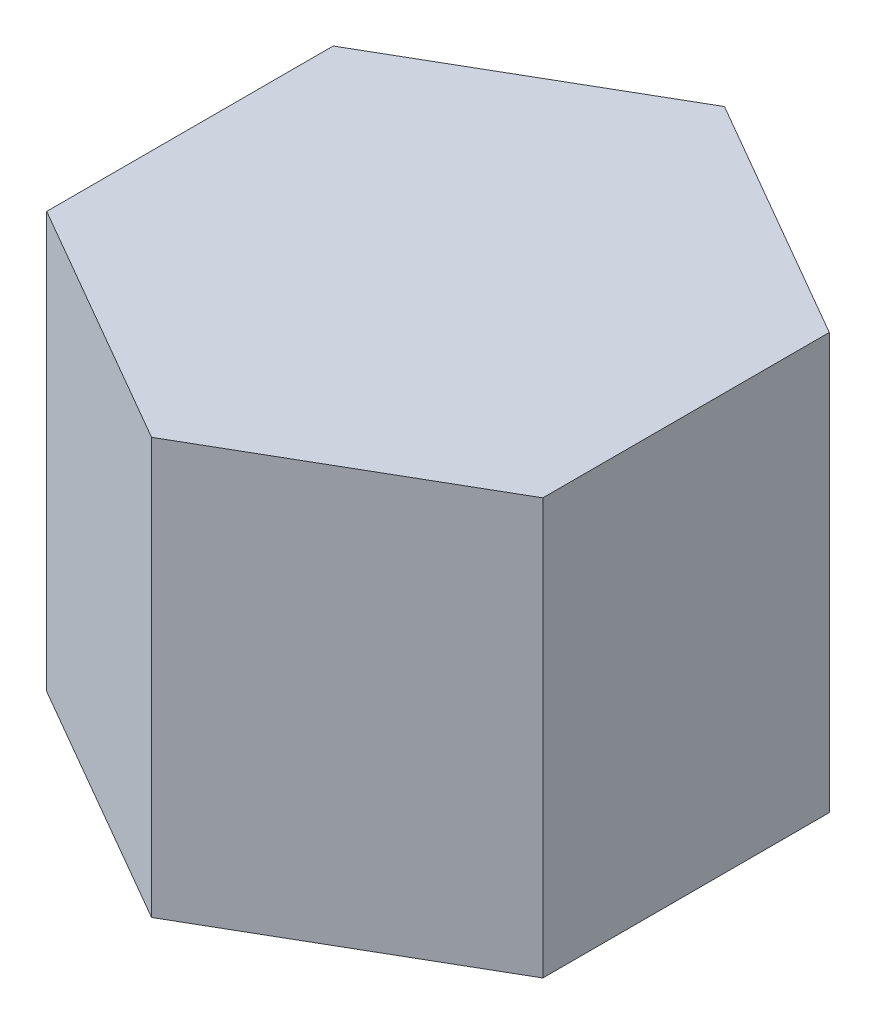
ISO-10303-21;
HEADER;
FILE_DESCRIPTION(('STEP AP214'),'2;1');
FILE_NAME('part.step','',(''),(''),'','','');
FILE_SCHEMA(('AUTOMOTIVE_DESIGN { 1 0 10303 214 1 1 1 1 }'));
ENDSEC;
DATA;
#1=APPLICATION_CONTEXT('core data for automotive mechanical design processes');
#2=APPLICATION_PROTOCOL_DEFINITION('international standard','automotive_design',2000,#1);
#3=PRODUCT_CONTEXT('',#1,'mechanical');
#4=PRODUCT('Part','Part','',(#3));
#5=PRODUCT_RELATED_PRODUCT_CATEGORY('part','',(#4));
#6=PRODUCT_DEFINITION_FORMATION('','',#4);
#7=PRODUCT_DEFINITION_CONTEXT('part definition',#1,'design');
#8=PRODUCT_DEFINITION('design','',#6,#7);
#9=PRODUCT_DEFINITION_SHAPE('','',#8);
#10=(LENGTH_UNIT() NAMED_UNIT(*) SI_UNIT(.MILLI.,.METRE.));
#11=(NAMED_UNIT(*) PLANE_ANGLE_UNIT() SI_UNIT($,.RADIAN.));
#12=(NAMED_UNIT(*) SI_UNIT($,.STERADIAN.) SOLID_ANGLE_UNIT());
#13=UNCERTAINTY_MEASURE_WITH_UNIT(LENGTH_MEASURE(1.E-05),#10,'distance_accuracy_value','');
#14=(GEOMETRIC_REPRESENTATION_CONTEXT(3) GLOBAL_UNCERTAINTY_ASSIGNED_CONTEXT((#13)) GLOBAL_UNIT_ASSIGNED_CONTEXT((#10,
#11,#12)) REPRESENTATION_CONTEXT('',''));
#15=CARTESIAN_POINT('',(0.,0.,0.));
#16=DIRECTION('',(0.,0.,1.));
#17=DIRECTION('',(1.,0.,0.));
#18=AXIS2_PLACEMENT_3D('',#15,#16,#17);
#19=CARTESIAN_POINT('',(204.642660308706,-148.537700895744,294.971072835632));
#20=DIRECTION('',(-0.499999999999943,0.,-0.866025403784472));
#21=DIRECTION('',(-0.866025403784472,0.,0.499999999999943));
#22=AXIS2_PLACEMENT_3D('',#19,#20,#21);
#23=PLANE('',#22);
#24=CARTESIAN_POINT('',(204.339551417381,-149.045793579175,295.146072835632));
#25=DIRECTION('',(0.866025403784471,0.,-0.499999999999943));
#26=VECTOR('',#25,1.);
#27=LINE('',#24,#26);
#28=CARTESIAN_POINT('',(204.339551417382,-149.045793579175,295.146072835632));
#29=VERTEX_POINT('',#28);
#30=CARTESIAN_POINT('',(204.642660308706,-149.045793579175,294.971072835632));
#31=VERTEX_POINT('',#30);
#32=EDGE_CURVE('E170',#29,#31,#27,.T.);
#33=ORIENTED_EDGE('',*,*,#32,.T.);
#34=CARTESIAN_POINT('',(204.642660308706,-148.537700895744,294.971072835632));
#35=DIRECTION('',(0.,-1.,0.));
#36=VECTOR('',#35,1.);
#37=LINE('',#34,#36);
#38=CARTESIAN_POINT('',(204.642660308706,-148.537700895744,294.971072835632));
#39=VERTEX_POINT('',#38);
#40=EDGE_CURVE('E35',#39,#31,#37,.T.);
#41=ORIENTED_EDGE('',*,*,#40,.F.);
#42=CARTESIAN_POINT('',(204.339551417381,-148.537700895744,295.146072835632));
#43=DIRECTION('',(0.866025403784471,0.,-0.499999999999943));
#44=VECTOR('',#43,1.);
#45=LINE('',#42,#44);
#46=CARTESIAN_POINT('',(204.339551417382,-148.537700895744,295.146072835632));
#47=VERTEX_POINT('',#46);
#48=EDGE_CURVE('E159',#47,#39,#45,.T.);
#49=ORIENTED_EDGE('',*,*,#48,.F.);
#50=CARTESIAN_POINT('',(204.339551417381,-148.537700895744,295.146072835632));
#51=DIRECTION('',(0.,-1.,0.));
#52=VECTOR('',#51,1.);
#53=LINE('',#50,#52);
#54=EDGE_CURVE('E10',#47,#29,#53,.T.);
#55=ORIENTED_EDGE('',*,*,#54,.T.);
#56=EDGE_LOOP('',(#33,#41,#49,#55));
#57=FACE_BOUND('',#56,.T.);
#58=ADVANCED_FACE('F16',(#57),#23,.F.);
#59=CARTESIAN_POINT('',(204.339551417382,-148.537700895744,295.146072835632));
#60=DIRECTION('',(0.499999999999978,0.,-0.866025403784452));
#61=DIRECTION('',(-0.866025403784452,0.,-0.499999999999978));
#62=AXIS2_PLACEMENT_3D('',#59,#60,#61);
#63=PLANE('',#62);
#64=CARTESIAN_POINT('',(204.036442526057,-149.045793579175,294.971072835632));
#65=DIRECTION('',(0.866025403784452,0.,0.499999999999978));
#66=VECTOR('',#65,1.);
#67=LINE('',#64,#66);
#68=CARTESIAN_POINT('',(204.036442526057,-149.045793579175,294.971072835632));
#69=VERTEX_POINT('',#68);
#70=EDGE_CURVE('E167',#69,#29,#67,.T.);
#71=ORIENTED_EDGE('',*,*,#70,.T.);
#72=ORIENTED_EDGE('',*,*,#54,.F.);
#73=CARTESIAN_POINT('',(204.036442526057,-148.537700895744,294.971072835632));
#74=DIRECTION('',(0.866025403784452,0.,0.499999999999978));
#75=VECTOR('',#74,1.);
#76=LINE('',#73,#75);
#77=CARTESIAN_POINT('',(204.036442526057,-148.537700895744,294.971072835632));
#78=VERTEX_POINT('',#77);
#79=EDGE_CURVE('E156',#78,#47,#76,.T.);
#80=ORIENTED_EDGE('',*,*,#79,.F.);
#81=CARTESIAN_POINT('',(204.036442526057,-148.537700895744,294.971072835632));
#82=DIRECTION('',(0.,-1.,0.));
#83=VECTOR('',#82,1.);
#84=LINE('',#81,#83);
#85=EDGE_CURVE('E27',#78,#69,#84,.T.);
#86=ORIENTED_EDGE('',*,*,#85,.T.);
#87=EDGE_LOOP('',(#71,#72,#80,#86));
#88=FACE_BOUND('',#87,.T.);
#89=ADVANCED_FACE('F189',(#88),#63,.F.);
#90=CARTESIAN_POINT('',(204.036442526057,-148.537700895744,290.831971220494));
#91=DIRECTION('',(1.,0.,0.));
#92=DIRECTION('',(0.,1.,0.));
#93=AXIS2_PLACEMENT_3D('',#90,#91,#92);
#94=PLANE('',#93);
#95=CARTESIAN_POINT('',(204.036442526057,-149.045793579175,294.621072835632));
#96=DIRECTION('',(0.,0.,1.));
#97=VECTOR('',#96,1.);
#98=LINE('',#95,#97);
#99=CARTESIAN_POINT('',(204.036442526057,-149.045793579175,294.621072835632));
#100=VERTEX_POINT('',#99);
#101=EDGE_CURVE('E163',#100,#69,#98,.T.);
#102=ORIENTED_EDGE('',*,*,#101,.T.);
#103=ORIENTED_EDGE('',*,*,#85,.F.);
#104=CARTESIAN_POINT('',(204.036442526057,-148.537700895744,294.621072835632));
#105=DIRECTION('',(0.,0.,1.));
#106=VECTOR('',#105,1.);
#107=LINE('',#104,#106);
#108=CARTESIAN_POINT('',(204.036442526057,-148.537700895744,294.621072835632));
#109=VERTEX_POINT('',#108);
#110=EDGE_CURVE('E106',#109,#78,#107,.T.);
#111=ORIENTED_EDGE('',*,*,#110,.F.);
#112=CARTESIAN_POINT('',(204.036442526057,-148.537700895744,294.621072835632));
#113=DIRECTION('',(0.,-1.,0.));
#114=VECTOR('',#113,1.);
#115=LINE('',#112,#114);
#116=EDGE_CURVE('E94',#109,#100,#115,.T.);
#117=ORIENTED_EDGE('',*,*,#116,.T.);
#118=EDGE_LOOP('',(#102,#103,#111,#117));
#119=FACE_BOUND('',#118,.T.);
#120=ADVANCED_FACE('F198',(#119),#94,.F.);
#121=CARTESIAN_POINT('',(204.036442526057,-148.537700895744,294.621072835632));
#122=DIRECTION('',(0.499999999999978,0.,0.866025403784452));
#123=DIRECTION('',(0.866025403784452,0.,-0.499999999999978));
#124=AXIS2_PLACEMENT_3D('',#121,#122,#123);
#125=PLANE('',#124);
#126=CARTESIAN_POINT('',(204.339551417382,-149.045793579175,294.446072835632));
#127=DIRECTION('',(-0.866025403784452,0.,0.499999999999978));
#128=VECTOR('',#127,1.);
#129=LINE('',#126,#128);
#130=CARTESIAN_POINT('',(204.339551417382,-149.045793579175,294.446072835632));
#131=VERTEX_POINT('',#130);
#132=EDGE_CURVE('E162',#131,#100,#129,.T.);
#133=ORIENTED_EDGE('',*,*,#132,.T.);
#134=ORIENTED_EDGE('',*,*,#116,.F.);
#135=CARTESIAN_POINT('',(204.339551417382,-148.537700895744,294.446072835632));
#136=DIRECTION('',(-0.866025403784452,0.,0.499999999999978));
#137=VECTOR('',#136,1.);
#138=LINE('',#135,#137);
#139=CARTESIAN_POINT('',(204.339551417382,-148.537700895744,294.446072835632));
#140=VERTEX_POINT('',#139);
#141=EDGE_CURVE('E98',#140,#109,#138,.T.);
#142=ORIENTED_EDGE('',*,*,#141,.F.);
#143=CARTESIAN_POINT('',(204.339551417382,-148.537700895744,294.446072835632));
#144=DIRECTION('',(0.,-1.,0.));
#145=VECTOR('',#144,1.);
#146=LINE('',#143,#145);
#147=EDGE_CURVE('E79',#140,#131,#146,.T.);
#148=ORIENTED_EDGE('',*,*,#147,.T.);
#149=EDGE_LOOP('',(#133,#134,#142,#148));
#150=FACE_BOUND('',#149,.T.);
#151=ADVANCED_FACE('F100',(#150),#125,.F.);
#152=CARTESIAN_POINT('',(204.339551417382,-148.537700895744,294.446072835632));
#153=DIRECTION('',(-0.500000000000096,0.,0.866025403784383));
#154=DIRECTION('',(0.866025403784383,0.,0.500000000000096));
#155=AXIS2_PLACEMENT_3D('',#152,#153,#154);
#156=PLANE('',#155);
#157=CARTESIAN_POINT('',(204.642660308706,-149.045793579175,294.621072835632));
#158=DIRECTION('',(-0.866025403784383,0.,-0.500000000000096));
#159=VECTOR('',#158,1.);
#160=LINE('',#157,#159);
#161=CARTESIAN_POINT('',(204.642660308706,-149.045793579175,294.621072835632));
#162=VERTEX_POINT('',#161);
#163=EDGE_CURVE('E88',#162,#131,#160,.T.);
#164=ORIENTED_EDGE('',*,*,#163,.T.);
#165=ORIENTED_EDGE('',*,*,#147,.F.);
#166=CARTESIAN_POINT('',(204.642660308706,-148.537700895744,294.621072835632));
#167=DIRECTION('',(-0.866025403784383,0.,-0.500000000000096));
#168=VECTOR('',#167,1.);
#169=LINE('',#166,#168);
#170=CARTESIAN_POINT('',(204.642660308706,-148.537700895744,294.621072835632));
#171=VERTEX_POINT('',#170);
#172=EDGE_CURVE('E84',#171,#140,#169,.T.);
#173=ORIENTED_EDGE('',*,*,#172,.F.);
#174=CARTESIAN_POINT('',(204.642660308706,-148.537700895744,294.621072835632));
#175=DIRECTION('',(0.,-1.,0.));
#176=VECTOR('',#175,1.);
#177=LINE('',#174,#176);
#178=EDGE_CURVE('E58',#171,#162,#177,.T.);
#179=ORIENTED_EDGE('',*,*,#178,.T.);
#180=EDGE_LOOP('',(#164,#165,#173,#179));
#181=FACE_BOUND('',#180,.T.);
#182=ADVANCED_FACE('F82',(#181),#156,.F.);
#183=CARTESIAN_POINT('',(204.642660308706,-148.537700895744,290.831971220494));
#184=DIRECTION('',(-1.,0.,0.));
#185=DIRECTION('',(0.,-1.,0.));
#186=AXIS2_PLACEMENT_3D('',#183,#184,#185);
#187=PLANE('',#186);
#188=CARTESIAN_POINT('',(204.642660308706,-149.045793579175,294.971072835632));
#189=DIRECTION('',(0.,0.,-1.));
#190=VECTOR('',#189,1.);
#191=LINE('',#188,#190);
#192=EDGE_CURVE('E160',#31,#162,#191,.T.);
#193=ORIENTED_EDGE('',*,*,#192,.T.);
#194=ORIENTED_EDGE('',*,*,#178,.F.);
#195=CARTESIAN_POINT('',(204.642660308706,-148.537700895744,294.971072835632));
#196=DIRECTION('',(0.,0.,-1.));
#197=VECTOR('',#196,1.);
#198=LINE('',#195,#197);
#199=EDGE_CURVE('E112',#39,#171,#198,.T.);
#200=ORIENTED_EDGE('',*,*,#199,.F.);
#201=ORIENTED_EDGE('',*,*,#40,.T.);
#202=EDGE_LOOP('',(#193,#194,#200,#201));
#203=FACE_BOUND('',#202,.T.);
#204=ADVANCED_FACE('F131',(#203),#187,.F.);
#205=CARTESIAN_POINT('',(206.339551417382,-148.537700895744,290.831971220494));
#206=DIRECTION('',(0.,-1.,0.));
#207=DIRECTION('',(1.,0.,0.));
#208=AXIS2_PLACEMENT_3D('',#205,#206,#207);
#209=PLANE('',#208);
#210=ORIENTED_EDGE('',*,*,#48,.T.);
#211=ORIENTED_EDGE('',*,*,#199,.T.);
#212=ORIENTED_EDGE('',*,*,#172,.T.);
#213=ORIENTED_EDGE('',*,*,#141,.T.);
#214=ORIENTED_EDGE('',*,*,#110,.T.);
#215=ORIENTED_EDGE('',*,*,#79,.T.);
#216=EDGE_LOOP('',(#210,#211,#212,#213,#214,#215));
#217=FACE_BOUND('',#216,.T.);
#218=ADVANCED_FACE('F111',(#217),#209,.F.);
#219=CARTESIAN_POINT('',(206.339551417382,-149.045793579175,290.831971220494));
#220=DIRECTION('',(0.,-1.,0.));
#221=DIRECTION('',(1.,0.,0.));
#222=AXIS2_PLACEMENT_3D('',#219,#220,#221);
#223=PLANE('',#222);
#224=ORIENTED_EDGE('',*,*,#32,.F.);
#225=ORIENTED_EDGE('',*,*,#70,.F.);
#226=ORIENTED_EDGE('',*,*,#101,.F.);
#227=ORIENTED_EDGE('',*,*,#132,.F.);
#228=ORIENTED_EDGE('',*,*,#163,.F.);
#229=ORIENTED_EDGE('',*,*,#192,.F.);
#230=EDGE_LOOP('',(#224,#225,#226,#227,#228,#229));
#231=FACE_BOUND('',#230,.T.);
#232=ADVANCED_FACE('F130',(#231),#223,.T.);
#233=CLOSED_SHELL('',(#58,#89,#120,#151,#182,#204,#218,#232));
#234=MANIFOLD_SOLID_BREP('B1',#233);
#235=ADVANCED_BREP_SHAPE_REPRESENTATION('',(#18,#234),#14);
#236=SHAPE_DEFINITION_REPRESENTATION(#9,#235);
ENDSEC;
END-ISO-10303-21;
